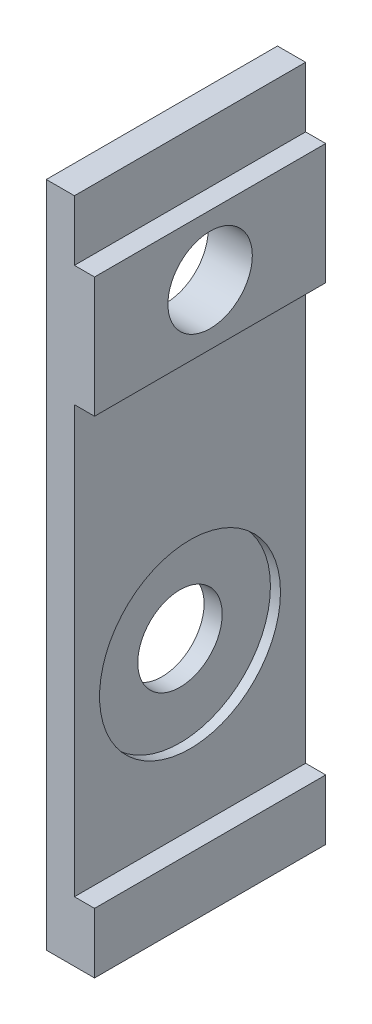
ISO-10303-21;
HEADER;
FILE_DESCRIPTION(('STEP AP214'),'2;1');
FILE_NAME('part.step','',(''),(''),'','','');
FILE_SCHEMA(('AUTOMOTIVE_DESIGN { 1 0 10303 214 1 1 1 1 }'));
ENDSEC;
DATA;
#1=APPLICATION_CONTEXT('core data for automotive mechanical design processes');
#2=APPLICATION_PROTOCOL_DEFINITION('international standard','automotive_design',2000,#1);
#3=PRODUCT_CONTEXT('',#1,'mechanical');
#4=PRODUCT('Part','Part','',(#3));
#5=PRODUCT_RELATED_PRODUCT_CATEGORY('part','',(#4));
#6=PRODUCT_DEFINITION_FORMATION('','',#4);
#7=PRODUCT_DEFINITION_CONTEXT('part definition',#1,'design');
#8=PRODUCT_DEFINITION('design','',#6,#7);
#9=PRODUCT_DEFINITION_SHAPE('','',#8);
#10=(LENGTH_UNIT() NAMED_UNIT(*) SI_UNIT(.MILLI.,.METRE.));
#11=(NAMED_UNIT(*) PLANE_ANGLE_UNIT() SI_UNIT($,.RADIAN.));
#12=(NAMED_UNIT(*) SI_UNIT($,.STERADIAN.) SOLID_ANGLE_UNIT());
#13=UNCERTAINTY_MEASURE_WITH_UNIT(LENGTH_MEASURE(1.E-05),#10,'distance_accuracy_value','');
#14=(GEOMETRIC_REPRESENTATION_CONTEXT(3) GLOBAL_UNCERTAINTY_ASSIGNED_CONTEXT((#13)) GLOBAL_UNIT_ASSIGNED_CONTEXT((#10,
#11,#12)) REPRESENTATION_CONTEXT('',''));
#15=CARTESIAN_POINT('',(0.,0.,0.));
#16=DIRECTION('',(0.,0.,1.));
#17=DIRECTION('',(1.,0.,0.));
#18=AXIS2_PLACEMENT_3D('',#15,#16,#17);
#19=CARTESIAN_POINT('',(-89.2533824815821,13.8635198135198,5.75));
#20=DIRECTION('',(1.,0.,0.));
#21=DIRECTION('',(0.,0.,-1.));
#22=AXIS2_PLACEMENT_3D('',#19,#20,#21);
#23=CYLINDRICAL_SURFACE('',#22,2.1);
#24=CARTESIAN_POINT('',(-86.853382481582,13.8635198135198,5.75));
#25=DIRECTION('',(1.,0.,0.));
#26=DIRECTION('',(0.,0.,-1.));
#27=AXIS2_PLACEMENT_3D('',#24,#25,#26);
#28=CIRCLE('',#27,2.1);
#29=CARTESIAN_POINT('',(-86.853382481582,13.8635198135198,3.65));
#30=VERTEX_POINT('',#29);
#31=EDGE_CURVE('E148',#30,#30,#28,.T.);
#32=ORIENTED_EDGE('',*,*,#31,.T.);
#33=EDGE_LOOP('',(#32));
#34=FACE_BOUND('',#33,.T.);
#35=CARTESIAN_POINT('',(-89.053382481582,13.8635198135198,5.75));
#36=DIRECTION('',(-1.,0.,0.));
#37=DIRECTION('',(0.,0.,1.));
#38=AXIS2_PLACEMENT_3D('',#35,#36,#37);
#39=CIRCLE('',#38,2.1);
#40=CARTESIAN_POINT('',(-89.053382481582,13.8635198135198,7.85));
#41=VERTEX_POINT('',#40);
#42=EDGE_CURVE('E37',#41,#41,#39,.F.);
#43=ORIENTED_EDGE('',*,*,#42,.F.);
#44=EDGE_LOOP('',(#43));
#45=FACE_BOUND('',#44,.T.);
#46=ADVANCED_FACE('F33',(#34,#45),#23,.F.);
#47=CARTESIAN_POINT('',(-89.2533824815821,-2.33648018648019,5.75));
#48=DIRECTION('',(1.,0.,0.));
#49=DIRECTION('',(0.,0.,-1.));
#50=AXIS2_PLACEMENT_3D('',#47,#48,#49);
#51=CYLINDRICAL_SURFACE('',#50,2.1);
#52=CARTESIAN_POINT('',(-89.2533824815821,-2.33648018648019,5.75));
#53=DIRECTION('',(1.,0.,0.));
#54=DIRECTION('',(0.,0.,-1.));
#55=AXIS2_PLACEMENT_3D('',#52,#53,#54);
#56=CIRCLE('',#55,2.1);
#57=CARTESIAN_POINT('',(-89.2533824815821,-2.33648018648019,3.65));
#58=VERTEX_POINT('',#57);
#59=EDGE_CURVE('E182',#58,#58,#56,.T.);
#60=ORIENTED_EDGE('',*,*,#59,.F.);
#61=EDGE_LOOP('',(#60));
#62=FACE_BOUND('',#61,.T.);
#63=CARTESIAN_POINT('',(-88.353382481582,-2.33648018648019,5.75));
#64=DIRECTION('',(1.,0.,0.));
#65=DIRECTION('',(0.,0.,-1.));
#66=AXIS2_PLACEMENT_3D('',#63,#64,#65);
#67=CIRCLE('',#66,2.1);
#68=CARTESIAN_POINT('',(-88.353382481582,-2.33648018648019,3.65));
#69=VERTEX_POINT('',#68);
#70=EDGE_CURVE('E180',#69,#69,#67,.F.);
#71=ORIENTED_EDGE('',*,*,#70,.F.);
#72=EDGE_LOOP('',(#71));
#73=FACE_BOUND('',#72,.T.);
#74=ADVANCED_FACE('F241',(#62,#73),#51,.F.);
#75=CARTESIAN_POINT('',(-89.2533824815821,-13.3364801864802,11.5));
#76=DIRECTION('',(0.,1.,0.));
#77=DIRECTION('',(0.,0.,1.));
#78=AXIS2_PLACEMENT_3D('',#75,#76,#77);
#79=PLANE('',#78);
#80=DIRECTION('',(1.,0.,0.));
#81=VECTOR('',#80,1.);
#82=CARTESIAN_POINT('',(-89.2533824815821,-13.3364801864802,0.));
#83=LINE('',#82,#81);
#84=CARTESIAN_POINT('',(-89.2533824815821,-13.3364801864802,0.));
#85=VERTEX_POINT('',#84);
#86=CARTESIAN_POINT('',(-86.853382481582,-13.3364801864802,0.));
#87=VERTEX_POINT('',#86);
#88=EDGE_CURVE('E144',#85,#87,#83,.T.);
#89=ORIENTED_EDGE('',*,*,#88,.T.);
#90=DIRECTION('',(0.,0.,-1.));
#91=VECTOR('',#90,1.);
#92=CARTESIAN_POINT('',(-86.853382481582,-13.3364801864802,11.5));
#93=LINE('',#92,#91);
#94=CARTESIAN_POINT('',(-86.853382481582,-13.3364801864802,11.5));
#95=VERTEX_POINT('',#94);
#96=EDGE_CURVE('E11',#95,#87,#93,.T.);
#97=ORIENTED_EDGE('',*,*,#96,.F.);
#98=DIRECTION('',(1.,0.,0.));
#99=VECTOR('',#98,1.);
#100=CARTESIAN_POINT('',(-89.2533824815821,-13.3364801864802,11.5));
#101=LINE('',#100,#99);
#102=CARTESIAN_POINT('',(-89.2533824815821,-13.3364801864802,11.5));
#103=VERTEX_POINT('',#102);
#104=EDGE_CURVE('E163',#103,#95,#101,.T.);
#105=ORIENTED_EDGE('',*,*,#104,.F.);
#106=DIRECTION('',(0.,0.,-1.));
#107=VECTOR('',#106,1.);
#108=CARTESIAN_POINT('',(-89.2533824815821,-13.3364801864802,11.5));
#109=LINE('',#108,#107);
#110=EDGE_CURVE('E140',#103,#85,#109,.T.);
#111=ORIENTED_EDGE('',*,*,#110,.T.);
#112=EDGE_LOOP('',(#89,#97,#105,#111));
#113=FACE_BOUND('',#112,.T.);
#114=ADVANCED_FACE('F35',(#113),#79,.F.);
#115=CARTESIAN_POINT('',(-86.853382481582,-13.3364801864802,11.5));
#116=DIRECTION('',(-1.,0.,0.));
#117=DIRECTION('',(0.,0.,1.));
#118=AXIS2_PLACEMENT_3D('',#115,#116,#117);
#119=PLANE('',#118);
#120=DIRECTION('',(0.,1.,0.));
#121=VECTOR('',#120,1.);
#122=CARTESIAN_POINT('',(-86.853382481582,-13.3364801864802,0.));
#123=LINE('',#122,#121);
#124=CARTESIAN_POINT('',(-86.853382481582,-10.3364801864802,0.));
#125=VERTEX_POINT('',#124);
#126=EDGE_CURVE('E147',#87,#125,#123,.T.);
#127=ORIENTED_EDGE('',*,*,#126,.T.);
#128=DIRECTION('',(0.,0.,-1.));
#129=VECTOR('',#128,1.);
#130=CARTESIAN_POINT('',(-86.853382481582,-10.3364801864802,11.5));
#131=LINE('',#130,#129);
#132=CARTESIAN_POINT('',(-86.853382481582,-10.3364801864802,11.5));
#133=VERTEX_POINT('',#132);
#134=EDGE_CURVE('E43',#133,#125,#131,.T.);
#135=ORIENTED_EDGE('',*,*,#134,.F.);
#136=DIRECTION('',(0.,1.,0.));
#137=VECTOR('',#136,1.);
#138=CARTESIAN_POINT('',(-86.853382481582,-13.3364801864802,11.5));
#139=LINE('',#138,#137);
#140=EDGE_CURVE('E101',#95,#133,#139,.T.);
#141=ORIENTED_EDGE('',*,*,#140,.F.);
#142=ORIENTED_EDGE('',*,*,#96,.T.);
#143=EDGE_LOOP('',(#127,#135,#141,#142));
#144=FACE_BOUND('',#143,.T.);
#145=ADVANCED_FACE('F374',(#144),#119,.F.);
#146=CARTESIAN_POINT('',(-86.853382481582,-10.3364801864802,11.5));
#147=DIRECTION('',(0.,-1.,0.));
#148=DIRECTION('',(0.,0.,-1.));
#149=AXIS2_PLACEMENT_3D('',#146,#147,#148);
#150=PLANE('',#149);
#151=DIRECTION('',(-1.,0.,0.));
#152=VECTOR('',#151,1.);
#153=CARTESIAN_POINT('',(-86.853382481582,-10.3364801864802,0.));
#154=LINE('',#153,#152);
#155=CARTESIAN_POINT('',(-87.853382481582,-10.3364801864802,0.));
#156=VERTEX_POINT('',#155);
#157=EDGE_CURVE('E150',#125,#156,#154,.T.);
#158=ORIENTED_EDGE('',*,*,#157,.T.);
#159=DIRECTION('',(0.,0.,-1.));
#160=VECTOR('',#159,1.);
#161=CARTESIAN_POINT('',(-87.853382481582,-10.3364801864802,11.5));
#162=LINE('',#161,#160);
#163=CARTESIAN_POINT('',(-87.853382481582,-10.3364801864802,11.5));
#164=VERTEX_POINT('',#163);
#165=EDGE_CURVE('E176',#164,#156,#162,.T.);
#166=ORIENTED_EDGE('',*,*,#165,.F.);
#167=DIRECTION('',(-1.,0.,0.));
#168=VECTOR('',#167,1.);
#169=CARTESIAN_POINT('',(-86.853382481582,-10.3364801864802,11.5));
#170=LINE('',#169,#168);
#171=EDGE_CURVE('E203',#133,#164,#170,.T.);
#172=ORIENTED_EDGE('',*,*,#171,.F.);
#173=ORIENTED_EDGE('',*,*,#134,.T.);
#174=EDGE_LOOP('',(#158,#166,#172,#173));
#175=FACE_BOUND('',#174,.T.);
#176=ADVANCED_FACE('F366',(#175),#150,.F.);
#177=CARTESIAN_POINT('',(-87.853382481582,10.8635198135198,11.5));
#178=DIRECTION('',(-1.,0.,0.));
#179=DIRECTION('',(0.,0.,1.));
#180=AXIS2_PLACEMENT_3D('',#177,#178,#179);
#181=PLANE('',#180);
#182=CARTESIAN_POINT('',(-87.853382481582,-2.33648018648019,5.75));
#183=DIRECTION('',(1.,0.,0.));
#184=DIRECTION('',(0.,0.,-1.));
#185=AXIS2_PLACEMENT_3D('',#182,#183,#184);
#186=CIRCLE('',#185,4.5);
#187=CARTESIAN_POINT('',(-87.853382481582,-2.33648018648019,1.25));
#188=VERTEX_POINT('',#187);
#189=EDGE_CURVE('E189',#188,#188,#186,.T.);
#190=ORIENTED_EDGE('',*,*,#189,.F.);
#191=EDGE_LOOP('',(#190));
#192=FACE_BOUND('',#191,.T.);
#193=DIRECTION('',(0.,1.,0.));
#194=VECTOR('',#193,1.);
#195=CARTESIAN_POINT('',(-87.853382481582,10.8635198135198,0.));
#196=LINE('',#195,#194);
#197=CARTESIAN_POINT('',(-87.853382481582,10.8635198135198,0.));
#198=VERTEX_POINT('',#197);
#199=EDGE_CURVE('E152',#156,#198,#196,.T.);
#200=ORIENTED_EDGE('',*,*,#199,.T.);
#201=DIRECTION('',(0.,0.,-1.));
#202=VECTOR('',#201,1.);
#203=CARTESIAN_POINT('',(-87.853382481582,10.8635198135198,11.5));
#204=LINE('',#203,#202);
#205=CARTESIAN_POINT('',(-87.853382481582,10.8635198135198,11.5));
#206=VERTEX_POINT('',#205);
#207=EDGE_CURVE('E173',#206,#198,#204,.T.);
#208=ORIENTED_EDGE('',*,*,#207,.F.);
#209=DIRECTION('',(0.,1.,0.));
#210=VECTOR('',#209,1.);
#211=CARTESIAN_POINT('',(-87.853382481582,10.8635198135198,11.5));
#212=LINE('',#211,#210);
#213=EDGE_CURVE('E205',#164,#206,#212,.T.);
#214=ORIENTED_EDGE('',*,*,#213,.F.);
#215=ORIENTED_EDGE('',*,*,#165,.T.);
#216=EDGE_LOOP('',(#200,#208,#214,#215));
#217=FACE_BOUND('',#216,.T.);
#218=ADVANCED_FACE('F357',(#192,#217),#181,.F.);
#219=CARTESIAN_POINT('',(-87.853382481582,10.8635198135198,11.5));
#220=DIRECTION('',(0.,1.,0.));
#221=DIRECTION('',(0.,0.,1.));
#222=AXIS2_PLACEMENT_3D('',#219,#220,#221);
#223=PLANE('',#222);
#224=DIRECTION('',(1.,0.,0.));
#225=VECTOR('',#224,1.);
#226=CARTESIAN_POINT('',(-87.853382481582,10.8635198135198,0.));
#227=LINE('',#226,#225);
#228=CARTESIAN_POINT('',(-86.853382481582,10.8635198135198,0.));
#229=VERTEX_POINT('',#228);
#230=EDGE_CURVE('E154',#198,#229,#227,.T.);
#231=ORIENTED_EDGE('',*,*,#230,.T.);
#232=DIRECTION('',(0.,0.,-1.));
#233=VECTOR('',#232,1.);
#234=CARTESIAN_POINT('',(-86.853382481582,10.8635198135198,11.5));
#235=LINE('',#234,#233);
#236=CARTESIAN_POINT('',(-86.853382481582,10.8635198135198,11.5));
#237=VERTEX_POINT('',#236);
#238=EDGE_CURVE('E170',#237,#229,#235,.T.);
#239=ORIENTED_EDGE('',*,*,#238,.F.);
#240=DIRECTION('',(1.,0.,0.));
#241=VECTOR('',#240,1.);
#242=CARTESIAN_POINT('',(-87.853382481582,10.8635198135198,11.5));
#243=LINE('',#242,#241);
#244=EDGE_CURVE('E207',#206,#237,#243,.T.);
#245=ORIENTED_EDGE('',*,*,#244,.F.);
#246=ORIENTED_EDGE('',*,*,#207,.T.);
#247=EDGE_LOOP('',(#231,#239,#245,#246));
#248=FACE_BOUND('',#247,.T.);
#249=ADVANCED_FACE('F349',(#248),#223,.F.);
#250=CARTESIAN_POINT('',(-86.853382481582,10.8635198135198,11.5));
#251=DIRECTION('',(-1.,0.,0.));
#252=DIRECTION('',(0.,0.,1.));
#253=AXIS2_PLACEMENT_3D('',#250,#251,#252);
#254=PLANE('',#253);
#255=ORIENTED_EDGE('',*,*,#31,.F.);
#256=EDGE_LOOP('',(#255));
#257=FACE_BOUND('',#256,.T.);
#258=DIRECTION('',(0.,1.,0.));
#259=VECTOR('',#258,1.);
#260=CARTESIAN_POINT('',(-86.853382481582,10.8635198135198,0.));
#261=LINE('',#260,#259);
#262=CARTESIAN_POINT('',(-86.853382481582,16.8635198135198,0.));
#263=VERTEX_POINT('',#262);
#264=EDGE_CURVE('E156',#229,#263,#261,.T.);
#265=ORIENTED_EDGE('',*,*,#264,.T.);
#266=DIRECTION('',(0.,0.,-1.));
#267=VECTOR('',#266,1.);
#268=CARTESIAN_POINT('',(-86.853382481582,16.8635198135198,11.5));
#269=LINE('',#268,#267);
#270=CARTESIAN_POINT('',(-86.853382481582,16.8635198135198,11.5));
#271=VERTEX_POINT('',#270);
#272=EDGE_CURVE('E167',#271,#263,#269,.T.);
#273=ORIENTED_EDGE('',*,*,#272,.F.);
#274=DIRECTION('',(0.,1.,0.));
#275=VECTOR('',#274,1.);
#276=CARTESIAN_POINT('',(-86.853382481582,10.8635198135198,11.5));
#277=LINE('',#276,#275);
#278=EDGE_CURVE('E209',#237,#271,#277,.T.);
#279=ORIENTED_EDGE('',*,*,#278,.F.);
#280=ORIENTED_EDGE('',*,*,#238,.T.);
#281=EDGE_LOOP('',(#265,#273,#279,#280));
#282=FACE_BOUND('',#281,.T.);
#283=ADVANCED_FACE('F215',(#257,#282),#254,.F.);
#284=CARTESIAN_POINT('',(-86.853382481582,16.8635198135198,11.5));
#285=DIRECTION('',(0.,-1.,0.));
#286=DIRECTION('',(0.,0.,-1.));
#287=AXIS2_PLACEMENT_3D('',#284,#285,#286);
#288=PLANE('',#287);
#289=DIRECTION('',(-1.,0.,0.));
#290=VECTOR('',#289,1.);
#291=CARTESIAN_POINT('',(-86.853382481582,16.8635198135198,0.));
#292=LINE('',#291,#290);
#293=CARTESIAN_POINT('',(-87.853382481582,16.8635198135198,0.));
#294=VERTEX_POINT('',#293);
#295=EDGE_CURVE('E158',#263,#294,#292,.T.);
#296=ORIENTED_EDGE('',*,*,#295,.T.);
#297=DIRECTION('',(0.,0.,-1.));
#298=VECTOR('',#297,1.);
#299=CARTESIAN_POINT('',(-87.853382481582,16.8635198135198,11.5));
#300=LINE('',#299,#298);
#301=CARTESIAN_POINT('',(-87.853382481582,16.8635198135198,11.5));
#302=VERTEX_POINT('',#301);
#303=EDGE_CURVE('E135',#302,#294,#300,.T.);
#304=ORIENTED_EDGE('',*,*,#303,.F.);
#305=DIRECTION('',(-1.,0.,0.));
#306=VECTOR('',#305,1.);
#307=CARTESIAN_POINT('',(-86.853382481582,16.8635198135198,11.5));
#308=LINE('',#307,#306);
#309=EDGE_CURVE('E126',#271,#302,#308,.T.);
#310=ORIENTED_EDGE('',*,*,#309,.F.);
#311=ORIENTED_EDGE('',*,*,#272,.T.);
#312=EDGE_LOOP('',(#296,#304,#310,#311));
#313=FACE_BOUND('',#312,.T.);
#314=ADVANCED_FACE('F219',(#313),#288,.F.);
#315=CARTESIAN_POINT('',(-87.853382481582,16.8635198135198,11.5));
#316=DIRECTION('',(-1.,0.,0.));
#317=DIRECTION('',(0.,0.,1.));
#318=AXIS2_PLACEMENT_3D('',#315,#316,#317);
#319=PLANE('',#318);
#320=DIRECTION('',(0.,1.,0.));
#321=VECTOR('',#320,1.);
#322=CARTESIAN_POINT('',(-87.853382481582,16.8635198135198,0.));
#323=LINE('',#322,#321);
#324=CARTESIAN_POINT('',(-87.853382481582,19.8635198135198,0.));
#325=VERTEX_POINT('',#324);
#326=EDGE_CURVE('E134',#294,#325,#323,.T.);
#327=ORIENTED_EDGE('',*,*,#326,.T.);
#328=DIRECTION('',(0.,0.,-1.));
#329=VECTOR('',#328,1.);
#330=CARTESIAN_POINT('',(-87.853382481582,19.8635198135198,11.5));
#331=LINE('',#330,#329);
#332=CARTESIAN_POINT('',(-87.853382481582,19.8635198135198,11.5));
#333=VERTEX_POINT('',#332);
#334=EDGE_CURVE('E131',#333,#325,#331,.T.);
#335=ORIENTED_EDGE('',*,*,#334,.F.);
#336=DIRECTION('',(0.,1.,0.));
#337=VECTOR('',#336,1.);
#338=CARTESIAN_POINT('',(-87.853382481582,16.8635198135198,11.5));
#339=LINE('',#338,#337);
#340=EDGE_CURVE('E120',#302,#333,#339,.T.);
#341=ORIENTED_EDGE('',*,*,#340,.F.);
#342=ORIENTED_EDGE('',*,*,#303,.T.);
#343=EDGE_LOOP('',(#327,#335,#341,#342));
#344=FACE_BOUND('',#343,.T.);
#345=ADVANCED_FACE('F132',(#344),#319,.F.);
#346=CARTESIAN_POINT('',(-89.2533824815821,19.8635198135198,11.5));
#347=DIRECTION('',(0.,-1.,0.));
#348=DIRECTION('',(0.,0.,-1.));
#349=AXIS2_PLACEMENT_3D('',#346,#347,#348);
#350=PLANE('',#349);
#351=DIRECTION('',(-1.,0.,0.));
#352=VECTOR('',#351,1.);
#353=CARTESIAN_POINT('',(-89.2533824815821,19.8635198135198,0.));
#354=LINE('',#353,#352);
#355=CARTESIAN_POINT('',(-89.2533824815821,19.8635198135198,0.));
#356=VERTEX_POINT('',#355);
#357=EDGE_CURVE('E87',#325,#356,#354,.T.);
#358=ORIENTED_EDGE('',*,*,#357,.T.);
#359=DIRECTION('',(0.,0.,-1.));
#360=VECTOR('',#359,1.);
#361=CARTESIAN_POINT('',(-89.2533824815821,19.8635198135198,11.5));
#362=LINE('',#361,#360);
#363=CARTESIAN_POINT('',(-89.2533824815821,19.8635198135198,11.5));
#364=VERTEX_POINT('',#363);
#365=EDGE_CURVE('E136',#364,#356,#362,.T.);
#366=ORIENTED_EDGE('',*,*,#365,.F.);
#367=DIRECTION('',(-1.,0.,0.));
#368=VECTOR('',#367,1.);
#369=CARTESIAN_POINT('',(-89.2533824815821,19.8635198135198,11.5));
#370=LINE('',#369,#368);
#371=EDGE_CURVE('E124',#333,#364,#370,.T.);
#372=ORIENTED_EDGE('',*,*,#371,.F.);
#373=ORIENTED_EDGE('',*,*,#334,.T.);
#374=EDGE_LOOP('',(#358,#366,#372,#373));
#375=FACE_BOUND('',#374,.T.);
#376=ADVANCED_FACE('F138',(#375),#350,.F.);
#377=CARTESIAN_POINT('',(-89.2533824815821,-13.3364801864802,11.5));
#378=DIRECTION('',(1.,0.,0.));
#379=DIRECTION('',(0.,0.,-1.));
#380=AXIS2_PLACEMENT_3D('',#377,#378,#379);
#381=PLANE('',#380);
#382=CARTESIAN_POINT('',(-89.2533824815821,13.8635198135198,5.75));
#383=DIRECTION('',(-1.,0.,0.));
#384=DIRECTION('',(0.,0.,1.));
#385=AXIS2_PLACEMENT_3D('',#382,#383,#384);
#386=CIRCLE('',#385,3.);
#387=CARTESIAN_POINT('',(-89.2533824815821,13.8635198135198,8.75));
#388=VERTEX_POINT('',#387);
#389=EDGE_CURVE('E196',#388,#388,#386,.T.);
#390=ORIENTED_EDGE('',*,*,#389,.F.);
#391=EDGE_LOOP('',(#390));
#392=FACE_BOUND('',#391,.T.);
#393=ORIENTED_EDGE('',*,*,#59,.T.);
#394=EDGE_LOOP('',(#393));
#395=FACE_BOUND('',#394,.T.);
#396=DIRECTION('',(0.,-1.,0.));
#397=VECTOR('',#396,1.);
#398=CARTESIAN_POINT('',(-89.2533824815821,-13.3364801864802,0.));
#399=LINE('',#398,#397);
#400=EDGE_CURVE('E93',#356,#85,#399,.T.);
#401=ORIENTED_EDGE('',*,*,#400,.T.);
#402=ORIENTED_EDGE('',*,*,#110,.F.);
#403=DIRECTION('',(0.,-1.,0.));
#404=VECTOR('',#403,1.);
#405=CARTESIAN_POINT('',(-89.2533824815821,-13.3364801864802,11.5));
#406=LINE('',#405,#404);
#407=EDGE_CURVE('E52',#364,#103,#406,.T.);
#408=ORIENTED_EDGE('',*,*,#407,.F.);
#409=ORIENTED_EDGE('',*,*,#365,.T.);
#410=EDGE_LOOP('',(#401,#402,#408,#409));
#411=FACE_BOUND('',#410,.T.);
#412=ADVANCED_FACE('F227',(#392,#395,#411),#381,.F.);
#413=CARTESIAN_POINT('',(0.,0.,11.5));
#414=DIRECTION('',(0.,0.,1.));
#415=DIRECTION('',(1.,0.,0.));
#416=AXIS2_PLACEMENT_3D('',#413,#414,#415);
#417=PLANE('',#416);
#418=ORIENTED_EDGE('',*,*,#104,.T.);
#419=ORIENTED_EDGE('',*,*,#140,.T.);
#420=ORIENTED_EDGE('',*,*,#171,.T.);
#421=ORIENTED_EDGE('',*,*,#213,.T.);
#422=ORIENTED_EDGE('',*,*,#244,.T.);
#423=ORIENTED_EDGE('',*,*,#278,.T.);
#424=ORIENTED_EDGE('',*,*,#309,.T.);
#425=ORIENTED_EDGE('',*,*,#340,.T.);
#426=ORIENTED_EDGE('',*,*,#371,.T.);
#427=ORIENTED_EDGE('',*,*,#407,.T.);
#428=EDGE_LOOP('',(#418,#419,#420,#421,#422,#423,#424,#425,#426,#427));
#429=FACE_BOUND('',#428,.T.);
#430=ADVANCED_FACE('F122',(#429),#417,.T.);
#431=CARTESIAN_POINT('',(0.,0.,0.));
#432=DIRECTION('',(0.,0.,1.));
#433=DIRECTION('',(1.,0.,0.));
#434=AXIS2_PLACEMENT_3D('',#431,#432,#433);
#435=PLANE('',#434);
#436=ORIENTED_EDGE('',*,*,#88,.F.);
#437=ORIENTED_EDGE('',*,*,#400,.F.);
#438=ORIENTED_EDGE('',*,*,#357,.F.);
#439=ORIENTED_EDGE('',*,*,#326,.F.);
#440=ORIENTED_EDGE('',*,*,#295,.F.);
#441=ORIENTED_EDGE('',*,*,#264,.F.);
#442=ORIENTED_EDGE('',*,*,#230,.F.);
#443=ORIENTED_EDGE('',*,*,#199,.F.);
#444=ORIENTED_EDGE('',*,*,#157,.F.);
#445=ORIENTED_EDGE('',*,*,#126,.F.);
#446=EDGE_LOOP('',(#436,#437,#438,#439,#440,#441,#442,#443,#444,#445));
#447=FACE_BOUND('',#446,.T.);
#448=ADVANCED_FACE('F222',(#447),#435,.F.);
#449=CARTESIAN_POINT('',(-88.353382481582,-2.33648018648019,5.75));
#450=DIRECTION('',(1.,0.,0.));
#451=DIRECTION('',(0.,0.,-1.));
#452=AXIS2_PLACEMENT_3D('',#449,#450,#451);
#453=PLANE('',#452);
#454=CARTESIAN_POINT('',(-88.353382481582,-2.33648018648019,5.75));
#455=DIRECTION('',(1.,0.,0.));
#456=DIRECTION('',(0.,0.,-1.));
#457=AXIS2_PLACEMENT_3D('',#454,#455,#456);
#458=CIRCLE('',#457,4.5);
#459=CARTESIAN_POINT('',(-88.353382481582,-2.33648018648019,1.25));
#460=VERTEX_POINT('',#459);
#461=EDGE_CURVE('E183',#460,#460,#458,.T.);
#462=ORIENTED_EDGE('',*,*,#461,.T.);
#463=EDGE_LOOP('',(#462));
#464=FACE_BOUND('',#463,.T.);
#465=ORIENTED_EDGE('',*,*,#70,.T.);
#466=EDGE_LOOP('',(#465));
#467=FACE_BOUND('',#466,.T.);
#468=ADVANCED_FACE('F254',(#464,#467),#453,.T.);
#469=CARTESIAN_POINT('',(-88.353382481582,-2.33648018648019,5.75));
#470=DIRECTION('',(1.,0.,0.));
#471=DIRECTION('',(0.,0.,-1.));
#472=AXIS2_PLACEMENT_3D('',#469,#470,#471);
#473=CYLINDRICAL_SURFACE('',#472,4.5);
#474=ORIENTED_EDGE('',*,*,#461,.F.);
#475=EDGE_LOOP('',(#474));
#476=FACE_BOUND('',#475,.T.);
#477=ORIENTED_EDGE('',*,*,#189,.T.);
#478=EDGE_LOOP('',(#477));
#479=FACE_BOUND('',#478,.T.);
#480=ADVANCED_FACE('F251',(#476,#479),#473,.F.);
#481=CARTESIAN_POINT('',(-89.053382481582,13.8635198135198,5.75));
#482=DIRECTION('',(-1.,0.,0.));
#483=DIRECTION('',(0.,0.,1.));
#484=AXIS2_PLACEMENT_3D('',#481,#482,#483);
#485=PLANE('',#484);
#486=CARTESIAN_POINT('',(-89.053382481582,13.8635198135198,5.75));
#487=DIRECTION('',(-1.,0.,0.));
#488=DIRECTION('',(0.,0.,1.));
#489=AXIS2_PLACEMENT_3D('',#486,#487,#488);
#490=CIRCLE('',#489,3.);
#491=CARTESIAN_POINT('',(-89.053382481582,13.8635198135198,8.75));
#492=VERTEX_POINT('',#491);
#493=EDGE_CURVE('E275',#492,#492,#490,.T.);
#494=ORIENTED_EDGE('',*,*,#493,.T.);
#495=EDGE_LOOP('',(#494));
#496=FACE_BOUND('',#495,.T.);
#497=ORIENTED_EDGE('',*,*,#42,.T.);
#498=EDGE_LOOP('',(#497));
#499=FACE_BOUND('',#498,.T.);
#500=ADVANCED_FACE('F261',(#496,#499),#485,.T.);
#501=CARTESIAN_POINT('',(-89.053382481582,13.8635198135198,5.75));
#502=DIRECTION('',(-1.,0.,0.));
#503=DIRECTION('',(0.,0.,1.));
#504=AXIS2_PLACEMENT_3D('',#501,#502,#503);
#505=CYLINDRICAL_SURFACE('',#504,3.);
#506=ORIENTED_EDGE('',*,*,#493,.F.);
#507=EDGE_LOOP('',(#506));
#508=FACE_BOUND('',#507,.T.);
#509=ORIENTED_EDGE('',*,*,#389,.T.);
#510=EDGE_LOOP('',(#509));
#511=FACE_BOUND('',#510,.T.);
#512=ADVANCED_FACE('F264',(#508,#511),#505,.F.);
#513=CLOSED_SHELL('',(#46,#74,#114,#145,#176,#218,#249,#283,#314,#345,#376,#412,#430,#448,#468,
#480,#500,#512));
#514=MANIFOLD_SOLID_BREP('B2',#513);
#515=ADVANCED_BREP_SHAPE_REPRESENTATION('',(#18,#514),#14);
#516=SHAPE_DEFINITION_REPRESENTATION(#9,#515);
ENDSEC;
END-ISO-10303-21;
